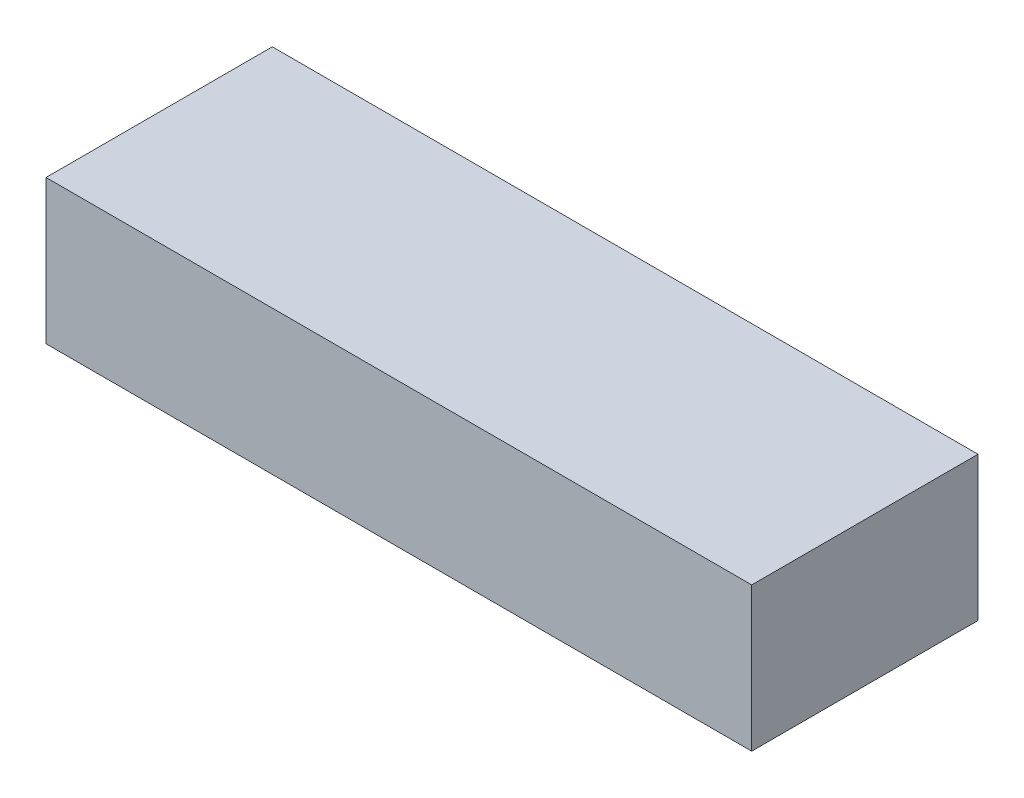
ISO-10303-21;
HEADER;
FILE_DESCRIPTION(('STEP AP214'),'2;1');
FILE_NAME('part.step','',(''),(''),'','','');
FILE_SCHEMA(('AUTOMOTIVE_DESIGN { 1 0 10303 214 1 1 1 1 }'));
ENDSEC;
DATA;
#1=APPLICATION_CONTEXT('core data for automotive mechanical design processes');
#2=APPLICATION_PROTOCOL_DEFINITION('international standard','automotive_design',2000,#1);
#3=PRODUCT_CONTEXT('',#1,'mechanical');
#4=PRODUCT('Part','Part','',(#3));
#5=PRODUCT_RELATED_PRODUCT_CATEGORY('part','',(#4));
#6=PRODUCT_DEFINITION_FORMATION('','',#4);
#7=PRODUCT_DEFINITION_CONTEXT('part definition',#1,'design');
#8=PRODUCT_DEFINITION('design','',#6,#7);
#9=PRODUCT_DEFINITION_SHAPE('','',#8);
#10=(LENGTH_UNIT() NAMED_UNIT(*) SI_UNIT(.MILLI.,.METRE.));
#11=(NAMED_UNIT(*) PLANE_ANGLE_UNIT() SI_UNIT($,.RADIAN.));
#12=(NAMED_UNIT(*) SI_UNIT($,.STERADIAN.) SOLID_ANGLE_UNIT());
#13=UNCERTAINTY_MEASURE_WITH_UNIT(LENGTH_MEASURE(1.E-05),#10,'distance_accuracy_value','');
#14=(GEOMETRIC_REPRESENTATION_CONTEXT(3) GLOBAL_UNCERTAINTY_ASSIGNED_CONTEXT((#13)) GLOBAL_UNIT_ASSIGNED_CONTEXT((#10,
#11,#12)) REPRESENTATION_CONTEXT('',''));
#15=CARTESIAN_POINT('',(0.,0.,0.));
#16=DIRECTION('',(0.,0.,1.));
#17=DIRECTION('',(1.,0.,0.));
#18=AXIS2_PLACEMENT_3D('',#15,#16,#17);
#19=CARTESIAN_POINT('',(-43.209090909091,10.,-15.71364));
#20=DIRECTION('',(1.,0.,0.));
#21=DIRECTION('',(0.,0.,-1.));
#22=AXIS2_PLACEMENT_3D('',#19,#20,#21);
#23=PLANE('',#22);
#24=DIRECTION('',(0.,0.,1.));
#25=VECTOR('',#24,1.);
#26=CARTESIAN_POINT('',(-43.209090909091,0.,-15.71364));
#27=LINE('',#26,#25);
#28=CARTESIAN_POINT('',(-43.209090909091,0.,-15.71364));
#29=VERTEX_POINT('',#28);
#30=CARTESIAN_POINT('',(-43.209090909091,0.,0.));
#31=VERTEX_POINT('',#30);
#32=EDGE_CURVE('E102',#29,#31,#27,.T.);
#33=ORIENTED_EDGE('',*,*,#32,.T.);
#34=DIRECTION('',(0.,-1.,0.));
#35=VECTOR('',#34,1.);
#36=CARTESIAN_POINT('',(-43.209090909091,10.,0.));
#37=LINE('',#36,#35);
#38=CARTESIAN_POINT('',(-43.209090909091,10.,0.));
#39=VERTEX_POINT('',#38);
#40=EDGE_CURVE('E11',#39,#31,#37,.T.);
#41=ORIENTED_EDGE('',*,*,#40,.F.);
#42=DIRECTION('',(0.,0.,1.));
#43=VECTOR('',#42,1.);
#44=CARTESIAN_POINT('',(-43.209090909091,10.,-15.71364));
#45=LINE('',#44,#43);
#46=CARTESIAN_POINT('',(-43.209090909091,10.,-15.71364));
#47=VERTEX_POINT('',#46);
#48=EDGE_CURVE('E90',#47,#39,#45,.T.);
#49=ORIENTED_EDGE('',*,*,#48,.F.);
#50=DIRECTION('',(0.,-1.,0.));
#51=VECTOR('',#50,1.);
#52=CARTESIAN_POINT('',(-43.209090909091,10.,-15.71364));
#53=LINE('',#52,#51);
#54=EDGE_CURVE('E98',#47,#29,#53,.T.);
#55=ORIENTED_EDGE('',*,*,#54,.T.);
#56=EDGE_LOOP('',(#33,#41,#49,#55));
#57=FACE_BOUND('',#56,.T.);
#58=ADVANCED_FACE('F39',(#57),#23,.F.);
#59=CARTESIAN_POINT('',(-43.209090909091,10.,0.));
#60=DIRECTION('',(0.,0.,-1.));
#61=DIRECTION('',(-1.,0.,0.));
#62=AXIS2_PLACEMENT_3D('',#59,#60,#61);
#63=PLANE('',#62);
#64=DIRECTION('',(1.,0.,0.));
#65=VECTOR('',#64,1.);
#66=CARTESIAN_POINT('',(-43.209090909091,0.,0.));
#67=LINE('',#66,#65);
#68=CARTESIAN_POINT('',(5.79090909090905,0.,0.));
#69=VERTEX_POINT('',#68);
#70=EDGE_CURVE('E94',#31,#69,#67,.T.);
#71=ORIENTED_EDGE('',*,*,#70,.T.);
#72=DIRECTION('',(0.,-1.,0.));
#73=VECTOR('',#72,1.);
#74=CARTESIAN_POINT('',(5.79090909090905,10.,0.));
#75=LINE('',#74,#73);
#76=CARTESIAN_POINT('',(5.79090909090905,10.,0.));
#77=VERTEX_POINT('',#76);
#78=EDGE_CURVE('E47',#77,#69,#75,.T.);
#79=ORIENTED_EDGE('',*,*,#78,.F.);
#80=DIRECTION('',(1.,0.,0.));
#81=VECTOR('',#80,1.);
#82=CARTESIAN_POINT('',(-43.209090909091,10.,0.));
#83=LINE('',#82,#81);
#84=EDGE_CURVE('E85',#39,#77,#83,.T.);
#85=ORIENTED_EDGE('',*,*,#84,.F.);
#86=ORIENTED_EDGE('',*,*,#40,.T.);
#87=EDGE_LOOP('',(#71,#79,#85,#86));
#88=FACE_BOUND('',#87,.T.);
#89=ADVANCED_FACE('F93',(#88),#63,.F.);
#90=CARTESIAN_POINT('',(5.79090909090905,10.,-15.71364));
#91=DIRECTION('',(-1.,0.,0.));
#92=DIRECTION('',(0.,0.,1.));
#93=AXIS2_PLACEMENT_3D('',#90,#91,#92);
#94=PLANE('',#93);
#95=DIRECTION('',(0.,0.,-1.));
#96=VECTOR('',#95,1.);
#97=CARTESIAN_POINT('',(5.79090909090905,0.,-15.71364));
#98=LINE('',#97,#96);
#99=CARTESIAN_POINT('',(5.79090909090905,0.,-15.71364));
#100=VERTEX_POINT('',#99);
#101=EDGE_CURVE('E72',#69,#100,#98,.T.);
#102=ORIENTED_EDGE('',*,*,#101,.T.);
#103=DIRECTION('',(0.,-1.,0.));
#104=VECTOR('',#103,1.);
#105=CARTESIAN_POINT('',(5.79090909090905,10.,-15.71364));
#106=LINE('',#105,#104);
#107=CARTESIAN_POINT('',(5.79090909090905,10.,-15.71364));
#108=VERTEX_POINT('',#107);
#109=EDGE_CURVE('E95',#108,#100,#106,.T.);
#110=ORIENTED_EDGE('',*,*,#109,.F.);
#111=DIRECTION('',(0.,0.,-1.));
#112=VECTOR('',#111,1.);
#113=CARTESIAN_POINT('',(5.79090909090905,10.,-15.71364));
#114=LINE('',#113,#112);
#115=EDGE_CURVE('E88',#77,#108,#114,.T.);
#116=ORIENTED_EDGE('',*,*,#115,.F.);
#117=ORIENTED_EDGE('',*,*,#78,.T.);
#118=EDGE_LOOP('',(#102,#110,#116,#117));
#119=FACE_BOUND('',#118,.T.);
#120=ADVANCED_FACE('F96',(#119),#94,.F.);
#121=CARTESIAN_POINT('',(-43.209090909091,10.,-15.71364));
#122=DIRECTION('',(0.,0.,1.));
#123=DIRECTION('',(1.,0.,0.));
#124=AXIS2_PLACEMENT_3D('',#121,#122,#123);
#125=PLANE('',#124);
#126=DIRECTION('',(-1.,0.,0.));
#127=VECTOR('',#126,1.);
#128=CARTESIAN_POINT('',(-43.209090909091,0.,-15.71364));
#129=LINE('',#128,#127);
#130=EDGE_CURVE('E78',#100,#29,#129,.T.);
#131=ORIENTED_EDGE('',*,*,#130,.T.);
#132=ORIENTED_EDGE('',*,*,#54,.F.);
#133=DIRECTION('',(-1.,0.,0.));
#134=VECTOR('',#133,1.);
#135=CARTESIAN_POINT('',(-43.209090909091,10.,-15.71364));
#136=LINE('',#135,#134);
#137=EDGE_CURVE('E55',#108,#47,#136,.T.);
#138=ORIENTED_EDGE('',*,*,#137,.F.);
#139=ORIENTED_EDGE('',*,*,#109,.T.);
#140=EDGE_LOOP('',(#131,#132,#138,#139));
#141=FACE_BOUND('',#140,.T.);
#142=ADVANCED_FACE('F109',(#141),#125,.F.);
#143=CARTESIAN_POINT('',(0.,10.,0.));
#144=DIRECTION('',(0.,1.,0.));
#145=DIRECTION('',(0.,0.,1.));
#146=AXIS2_PLACEMENT_3D('',#143,#144,#145);
#147=PLANE('',#146);
#148=ORIENTED_EDGE('',*,*,#48,.T.);
#149=ORIENTED_EDGE('',*,*,#84,.T.);
#150=ORIENTED_EDGE('',*,*,#115,.T.);
#151=ORIENTED_EDGE('',*,*,#137,.T.);
#152=EDGE_LOOP('',(#148,#149,#150,#151));
#153=FACE_BOUND('',#152,.T.);
#154=ADVANCED_FACE('F86',(#153),#147,.T.);
#155=CARTESIAN_POINT('',(0.,0.,0.));
#156=DIRECTION('',(0.,1.,0.));
#157=DIRECTION('',(0.,0.,1.));
#158=AXIS2_PLACEMENT_3D('',#155,#156,#157);
#159=PLANE('',#158);
#160=ORIENTED_EDGE('',*,*,#32,.F.);
#161=ORIENTED_EDGE('',*,*,#130,.F.);
#162=ORIENTED_EDGE('',*,*,#101,.F.);
#163=ORIENTED_EDGE('',*,*,#70,.F.);
#164=EDGE_LOOP('',(#160,#161,#162,#163));
#165=FACE_BOUND('',#164,.T.);
#166=ADVANCED_FACE('F112',(#165),#159,.F.);
#167=CLOSED_SHELL('',(#58,#89,#120,#142,#154,#166));
#168=MANIFOLD_SOLID_BREP('B2',#167);
#169=ADVANCED_BREP_SHAPE_REPRESENTATION('',(#18,#168),#14);
#170=SHAPE_DEFINITION_REPRESENTATION(#9,#169);
ENDSEC;
END-ISO-10303-21;
